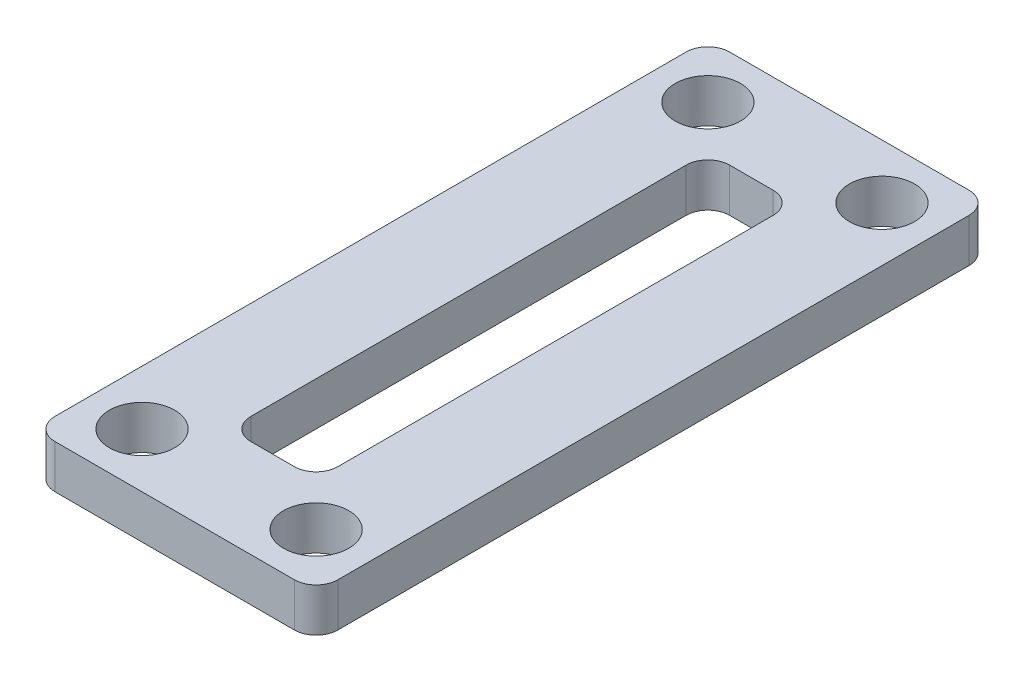
ISO-10303-21;
HEADER;
FILE_DESCRIPTION(('STEP AP214'),'2;1');
FILE_NAME('part.step','',(''),(''),'','','');
FILE_SCHEMA(('AUTOMOTIVE_DESIGN { 1 0 10303 214 1 1 1 1 }'));
ENDSEC;
DATA;
#1=APPLICATION_CONTEXT('core data for automotive mechanical design processes');
#2=APPLICATION_PROTOCOL_DEFINITION('international standard','automotive_design',2000,#1);
#3=PRODUCT_CONTEXT('',#1,'mechanical');
#4=PRODUCT('Part','Part','',(#3));
#5=PRODUCT_RELATED_PRODUCT_CATEGORY('part','',(#4));
#6=PRODUCT_DEFINITION_FORMATION('','',#4);
#7=PRODUCT_DEFINITION_CONTEXT('part definition',#1,'design');
#8=PRODUCT_DEFINITION('design','',#6,#7);
#9=PRODUCT_DEFINITION_SHAPE('','',#8);
#10=(LENGTH_UNIT() NAMED_UNIT(*) SI_UNIT(.MILLI.,.METRE.));
#11=(NAMED_UNIT(*) PLANE_ANGLE_UNIT() SI_UNIT($,.RADIAN.));
#12=(NAMED_UNIT(*) SI_UNIT($,.STERADIAN.) SOLID_ANGLE_UNIT());
#13=UNCERTAINTY_MEASURE_WITH_UNIT(LENGTH_MEASURE(1.E-05),#10,'distance_accuracy_value','');
#14=(GEOMETRIC_REPRESENTATION_CONTEXT(3) GLOBAL_UNCERTAINTY_ASSIGNED_CONTEXT((#13)) GLOBAL_UNIT_ASSIGNED_CONTEXT((#10,
#11,#12)) REPRESENTATION_CONTEXT('',''));
#15=CARTESIAN_POINT('',(0.,0.,0.));
#16=DIRECTION('',(0.,0.,1.));
#17=DIRECTION('',(1.,0.,0.));
#18=AXIS2_PLACEMENT_3D('',#15,#16,#17);
#19=CARTESIAN_POINT('',(10.5,5.5,-28.5));
#20=DIRECTION('',(-1.,0.,0.));
#21=DIRECTION('',(0.,0.,1.));
#22=AXIS2_PLACEMENT_3D('',#19,#20,#21);
#23=PLANE('',#22);
#24=DIRECTION('',(0.,0.,-1.));
#25=VECTOR('',#24,1.);
#26=CARTESIAN_POINT('',(10.5,2.,-28.5));
#27=LINE('',#26,#25);
#28=CARTESIAN_POINT('',(10.5,2.,1.5));
#29=VERTEX_POINT('',#28);
#30=CARTESIAN_POINT('',(10.5,2.,-27.5));
#31=VERTEX_POINT('',#30);
#32=EDGE_CURVE('E148',#29,#31,#27,.T.);
#33=ORIENTED_EDGE('',*,*,#32,.F.);
#34=DIRECTION('',(0.,-1.,0.));
#35=VECTOR('',#34,1.);
#36=CARTESIAN_POINT('',(10.5,5.5,1.5));
#37=LINE('',#36,#35);
#38=CARTESIAN_POINT('',(10.5,0.,1.5));
#39=VERTEX_POINT('',#38);
#40=EDGE_CURVE('E159',#29,#39,#37,.T.);
#41=ORIENTED_EDGE('',*,*,#40,.T.);
#42=DIRECTION('',(0.,0.,-1.));
#43=VECTOR('',#42,1.);
#44=CARTESIAN_POINT('',(10.5,0.,-28.5));
#45=LINE('',#44,#43);
#46=CARTESIAN_POINT('',(10.5,0.,-27.5));
#47=VERTEX_POINT('',#46);
#48=EDGE_CURVE('E229',#39,#47,#45,.T.);
#49=ORIENTED_EDGE('',*,*,#48,.T.);
#50=DIRECTION('',(0.,-1.,0.));
#51=VECTOR('',#50,1.);
#52=CARTESIAN_POINT('',(10.5,5.5,-27.5));
#53=LINE('',#52,#51);
#54=EDGE_CURVE('E162',#47,#31,#53,.F.);
#55=ORIENTED_EDGE('',*,*,#54,.T.);
#56=EDGE_LOOP('',(#33,#41,#49,#55));
#57=FACE_BOUND('',#56,.T.);
#58=ADVANCED_FACE('F34',(#57),#23,.F.);
#59=CARTESIAN_POINT('',(-2.5,5.5,-28.5));
#60=DIRECTION('',(0.,0.,1.));
#61=DIRECTION('',(1.,0.,0.));
#62=AXIS2_PLACEMENT_3D('',#59,#60,#61);
#63=PLANE('',#62);
#64=DIRECTION('',(-1.,0.,0.));
#65=VECTOR('',#64,1.);
#66=CARTESIAN_POINT('',(-2.5,2.,-28.5));
#67=LINE('',#66,#65);
#68=CARTESIAN_POINT('',(9.5,2.,-28.5));
#69=VERTEX_POINT('',#68);
#70=CARTESIAN_POINT('',(-1.5,2.,-28.5));
#71=VERTEX_POINT('',#70);
#72=EDGE_CURVE('E279',#69,#71,#67,.T.);
#73=ORIENTED_EDGE('',*,*,#72,.F.);
#74=DIRECTION('',(0.,-1.,0.));
#75=VECTOR('',#74,1.);
#76=CARTESIAN_POINT('',(9.5,5.5,-28.5));
#77=LINE('',#76,#75);
#78=CARTESIAN_POINT('',(9.5,0.,-28.5));
#79=VERTEX_POINT('',#78);
#80=EDGE_CURVE('E172',#69,#79,#77,.T.);
#81=ORIENTED_EDGE('',*,*,#80,.T.);
#82=DIRECTION('',(-1.,0.,0.));
#83=VECTOR('',#82,1.);
#84=CARTESIAN_POINT('',(-2.5,0.,-28.5));
#85=LINE('',#84,#83);
#86=CARTESIAN_POINT('',(-1.5,0.,-28.5));
#87=VERTEX_POINT('',#86);
#88=EDGE_CURVE('E235',#79,#87,#85,.T.);
#89=ORIENTED_EDGE('',*,*,#88,.T.);
#90=DIRECTION('',(0.,-1.,0.));
#91=VECTOR('',#90,1.);
#92=CARTESIAN_POINT('',(-1.5,5.5,-28.5));
#93=LINE('',#92,#91);
#94=EDGE_CURVE('E167',#87,#71,#93,.F.);
#95=ORIENTED_EDGE('',*,*,#94,.T.);
#96=EDGE_LOOP('',(#73,#81,#89,#95));
#97=FACE_BOUND('',#96,.T.);
#98=ADVANCED_FACE('F276',(#97),#63,.F.);
#99=CARTESIAN_POINT('',(-2.5,5.5,2.5));
#100=DIRECTION('',(1.,0.,0.));
#101=DIRECTION('',(0.,0.,-1.));
#102=AXIS2_PLACEMENT_3D('',#99,#100,#101);
#103=PLANE('',#102);
#104=DIRECTION('',(0.,0.,1.));
#105=VECTOR('',#104,1.);
#106=CARTESIAN_POINT('',(-2.5,2.,2.5));
#107=LINE('',#106,#105);
#108=CARTESIAN_POINT('',(-2.5,2.,-27.5));
#109=VERTEX_POINT('',#108);
#110=CARTESIAN_POINT('',(-2.5,2.,1.5));
#111=VERTEX_POINT('',#110);
#112=EDGE_CURVE('E292',#109,#111,#107,.T.);
#113=ORIENTED_EDGE('',*,*,#112,.F.);
#114=DIRECTION('',(0.,-1.,0.));
#115=VECTOR('',#114,1.);
#116=CARTESIAN_POINT('',(-2.5,5.5,-27.5));
#117=LINE('',#116,#115);
#118=CARTESIAN_POINT('',(-2.5,0.,-27.5));
#119=VERTEX_POINT('',#118);
#120=EDGE_CURVE('E264',#109,#119,#117,.T.);
#121=ORIENTED_EDGE('',*,*,#120,.T.);
#122=DIRECTION('',(0.,0.,1.));
#123=VECTOR('',#122,1.);
#124=CARTESIAN_POINT('',(-2.5,0.,2.5));
#125=LINE('',#124,#123);
#126=CARTESIAN_POINT('',(-2.5,0.,1.5));
#127=VERTEX_POINT('',#126);
#128=EDGE_CURVE('E214',#119,#127,#125,.T.);
#129=ORIENTED_EDGE('',*,*,#128,.T.);
#130=DIRECTION('',(0.,-1.,0.));
#131=VECTOR('',#130,1.);
#132=CARTESIAN_POINT('',(-2.5,5.5,1.5));
#133=LINE('',#132,#131);
#134=EDGE_CURVE('E261',#127,#111,#133,.F.);
#135=ORIENTED_EDGE('',*,*,#134,.T.);
#136=EDGE_LOOP('',(#113,#121,#129,#135));
#137=FACE_BOUND('',#136,.T.);
#138=ADVANCED_FACE('F353',(#137),#103,.F.);
#139=CARTESIAN_POINT('',(4.,5.5,2.5));
#140=DIRECTION('',(0.,0.,-1.));
#141=DIRECTION('',(-1.,0.,0.));
#142=AXIS2_PLACEMENT_3D('',#139,#140,#141);
#143=PLANE('',#142);
#144=DIRECTION('',(1.,0.,0.));
#145=VECTOR('',#144,1.);
#146=CARTESIAN_POINT('',(4.,2.,2.5));
#147=LINE('',#146,#145);
#148=CARTESIAN_POINT('',(-1.5,2.,2.5));
#149=VERTEX_POINT('',#148);
#150=CARTESIAN_POINT('',(9.50000000000001,2.,2.5));
#151=VERTEX_POINT('',#150);
#152=EDGE_CURVE('E59',#149,#151,#147,.T.);
#153=ORIENTED_EDGE('',*,*,#152,.F.);
#154=DIRECTION('',(0.,-1.,0.));
#155=VECTOR('',#154,1.);
#156=CARTESIAN_POINT('',(-1.5,5.5,2.5));
#157=LINE('',#156,#155);
#158=CARTESIAN_POINT('',(-1.5,0.,2.5));
#159=VERTEX_POINT('',#158);
#160=EDGE_CURVE('E177',#149,#159,#157,.T.);
#161=ORIENTED_EDGE('',*,*,#160,.T.);
#162=DIRECTION('',(1.,0.,0.));
#163=VECTOR('',#162,1.);
#164=CARTESIAN_POINT('',(4.,0.,2.5));
#165=LINE('',#164,#163);
#166=CARTESIAN_POINT('',(9.50000000000001,0.,2.5));
#167=VERTEX_POINT('',#166);
#168=EDGE_CURVE('E239',#159,#167,#165,.T.);
#169=ORIENTED_EDGE('',*,*,#168,.T.);
#170=DIRECTION('',(0.,-1.,0.));
#171=VECTOR('',#170,1.);
#172=CARTESIAN_POINT('',(9.50000000000001,5.5,2.5));
#173=LINE('',#172,#171);
#174=EDGE_CURVE('E169',#167,#151,#173,.F.);
#175=ORIENTED_EDGE('',*,*,#174,.T.);
#176=EDGE_LOOP('',(#153,#161,#169,#175));
#177=FACE_BOUND('',#176,.T.);
#178=ADVANCED_FACE('F476',(#177),#143,.F.);
#179=CARTESIAN_POINT('',(2.,5.5,-24.));
#180=DIRECTION('',(0.,0.,1.));
#181=DIRECTION('',(1.,0.,0.));
#182=AXIS2_PLACEMENT_3D('',#179,#180,#181);
#183=PLANE('',#182);
#184=DIRECTION('',(0.,-1.,0.));
#185=VECTOR('',#184,1.);
#186=CARTESIAN_POINT('',(5.,5.5,-24.));
#187=LINE('',#186,#185);
#188=CARTESIAN_POINT('',(5.,0.,-24.));
#189=VERTEX_POINT('',#188);
#190=CARTESIAN_POINT('',(5.,2.,-24.));
#191=VERTEX_POINT('',#190);
#192=EDGE_CURVE('E258',#189,#191,#187,.F.);
#193=ORIENTED_EDGE('',*,*,#192,.T.);
#194=DIRECTION('',(-1.,0.,0.));
#195=VECTOR('',#194,1.);
#196=CARTESIAN_POINT('',(2.,2.,-24.));
#197=LINE('',#196,#195);
#198=CARTESIAN_POINT('',(3.,2.,-24.));
#199=VERTEX_POINT('',#198);
#200=EDGE_CURVE('E297',#191,#199,#197,.T.);
#201=ORIENTED_EDGE('',*,*,#200,.T.);
#202=DIRECTION('',(0.,-1.,0.));
#203=VECTOR('',#202,1.);
#204=CARTESIAN_POINT('',(3.,0.,-24.));
#205=LINE('',#204,#203);
#206=CARTESIAN_POINT('',(3.,0.,-24.));
#207=VERTEX_POINT('',#206);
#208=EDGE_CURVE('E256',#199,#207,#205,.T.);
#209=ORIENTED_EDGE('',*,*,#208,.T.);
#210=DIRECTION('',(-1.,0.,0.));
#211=VECTOR('',#210,1.);
#212=CARTESIAN_POINT('',(2.,0.,-24.));
#213=LINE('',#212,#211);
#214=EDGE_CURVE('E187',#189,#207,#213,.T.);
#215=ORIENTED_EDGE('',*,*,#214,.F.);
#216=EDGE_LOOP('',(#193,#201,#209,#215));
#217=FACE_BOUND('',#216,.T.);
#218=ADVANCED_FACE('F317',(#217),#183,.T.);
#219=CARTESIAN_POINT('',(2.,5.5,-2.));
#220=DIRECTION('',(1.,0.,0.));
#221=DIRECTION('',(0.,0.,-1.));
#222=AXIS2_PLACEMENT_3D('',#219,#220,#221);
#223=PLANE('',#222);
#224=DIRECTION('',(0.,-1.,0.));
#225=VECTOR('',#224,1.);
#226=CARTESIAN_POINT('',(2.,5.5,-23.));
#227=LINE('',#226,#225);
#228=CARTESIAN_POINT('',(2.,0.,-23.));
#229=VERTEX_POINT('',#228);
#230=CARTESIAN_POINT('',(2.,2.,-23.));
#231=VERTEX_POINT('',#230);
#232=EDGE_CURVE('E251',#229,#231,#227,.F.);
#233=ORIENTED_EDGE('',*,*,#232,.T.);
#234=DIRECTION('',(0.,0.,1.));
#235=VECTOR('',#234,1.);
#236=CARTESIAN_POINT('',(2.,2.,-2.));
#237=LINE('',#236,#235);
#238=CARTESIAN_POINT('',(2.,2.,-3.));
#239=VERTEX_POINT('',#238);
#240=EDGE_CURVE('E51',#231,#239,#237,.T.);
#241=ORIENTED_EDGE('',*,*,#240,.T.);
#242=DIRECTION('',(0.,-1.,0.));
#243=VECTOR('',#242,1.);
#244=CARTESIAN_POINT('',(2.,0.,-3.));
#245=LINE('',#244,#243);
#246=CARTESIAN_POINT('',(2.,0.,-3.));
#247=VERTEX_POINT('',#246);
#248=EDGE_CURVE('E254',#239,#247,#245,.T.);
#249=ORIENTED_EDGE('',*,*,#248,.T.);
#250=DIRECTION('',(0.,0.,1.));
#251=VECTOR('',#250,1.);
#252=CARTESIAN_POINT('',(2.,0.,-2.));
#253=LINE('',#252,#251);
#254=EDGE_CURVE('E227',#229,#247,#253,.T.);
#255=ORIENTED_EDGE('',*,*,#254,.F.);
#256=EDGE_LOOP('',(#233,#241,#249,#255));
#257=FACE_BOUND('',#256,.T.);
#258=ADVANCED_FACE('F336',(#257),#223,.T.);
#259=CARTESIAN_POINT('',(6.,5.5,-2.));
#260=DIRECTION('',(0.,0.,-1.));
#261=DIRECTION('',(-1.,0.,0.));
#262=AXIS2_PLACEMENT_3D('',#259,#260,#261);
#263=PLANE('',#262);
#264=DIRECTION('',(0.,-1.,0.));
#265=VECTOR('',#264,1.);
#266=CARTESIAN_POINT('',(3.,5.5,-2.));
#267=LINE('',#266,#265);
#268=CARTESIAN_POINT('',(3.,0.,-2.));
#269=VERTEX_POINT('',#268);
#270=CARTESIAN_POINT('',(3.,2.,-2.));
#271=VERTEX_POINT('',#270);
#272=EDGE_CURVE('E242',#269,#271,#267,.F.);
#273=ORIENTED_EDGE('',*,*,#272,.T.);
#274=DIRECTION('',(1.,0.,0.));
#275=VECTOR('',#274,1.);
#276=CARTESIAN_POINT('',(6.,2.,-2.));
#277=LINE('',#276,#275);
#278=CARTESIAN_POINT('',(5.,2.,-2.));
#279=VERTEX_POINT('',#278);
#280=EDGE_CURVE('E307',#271,#279,#277,.T.);
#281=ORIENTED_EDGE('',*,*,#280,.T.);
#282=DIRECTION('',(0.,-1.,0.));
#283=VECTOR('',#282,1.);
#284=CARTESIAN_POINT('',(5.,0.,-2.));
#285=LINE('',#284,#283);
#286=CARTESIAN_POINT('',(5.,0.,-2.));
#287=VERTEX_POINT('',#286);
#288=EDGE_CURVE('E244',#279,#287,#285,.T.);
#289=ORIENTED_EDGE('',*,*,#288,.T.);
#290=DIRECTION('',(1.,0.,0.));
#291=VECTOR('',#290,1.);
#292=CARTESIAN_POINT('',(6.,0.,-2.));
#293=LINE('',#292,#291);
#294=EDGE_CURVE('E217',#269,#287,#293,.T.);
#295=ORIENTED_EDGE('',*,*,#294,.F.);
#296=EDGE_LOOP('',(#273,#281,#289,#295));
#297=FACE_BOUND('',#296,.T.);
#298=ADVANCED_FACE('F331',(#297),#263,.T.);
#299=CARTESIAN_POINT('',(6.,5.5,-24.));
#300=DIRECTION('',(-1.,0.,0.));
#301=DIRECTION('',(0.,0.,1.));
#302=AXIS2_PLACEMENT_3D('',#299,#300,#301);
#303=PLANE('',#302);
#304=DIRECTION('',(0.,-1.,0.));
#305=VECTOR('',#304,1.);
#306=CARTESIAN_POINT('',(6.,5.5,-3.));
#307=LINE('',#306,#305);
#308=CARTESIAN_POINT('',(6.,0.,-3.));
#309=VERTEX_POINT('',#308);
#310=CARTESIAN_POINT('',(6.,2.,-3.));
#311=VERTEX_POINT('',#310);
#312=EDGE_CURVE('E248',#309,#311,#307,.F.);
#313=ORIENTED_EDGE('',*,*,#312,.T.);
#314=DIRECTION('',(0.,0.,-1.));
#315=VECTOR('',#314,1.);
#316=CARTESIAN_POINT('',(6.,2.,-24.));
#317=LINE('',#316,#315);
#318=CARTESIAN_POINT('',(6.,2.,-23.));
#319=VERTEX_POINT('',#318);
#320=EDGE_CURVE('E304',#311,#319,#317,.T.);
#321=ORIENTED_EDGE('',*,*,#320,.T.);
#322=DIRECTION('',(0.,-1.,0.));
#323=VECTOR('',#322,1.);
#324=CARTESIAN_POINT('',(6.,0.,-23.));
#325=LINE('',#324,#323);
#326=CARTESIAN_POINT('',(6.,0.,-23.));
#327=VERTEX_POINT('',#326);
#328=EDGE_CURVE('E246',#319,#327,#325,.T.);
#329=ORIENTED_EDGE('',*,*,#328,.T.);
#330=DIRECTION('',(0.,0.,-1.));
#331=VECTOR('',#330,1.);
#332=CARTESIAN_POINT('',(6.,0.,-24.));
#333=LINE('',#332,#331);
#334=EDGE_CURVE('E226',#309,#327,#333,.T.);
#335=ORIENTED_EDGE('',*,*,#334,.F.);
#336=EDGE_LOOP('',(#313,#321,#329,#335));
#337=FACE_BOUND('',#336,.T.);
#338=ADVANCED_FACE('F325',(#337),#303,.T.);
#339=CARTESIAN_POINT('',(5.,5.5,-3.));
#340=DIRECTION('',(0.,1.,0.));
#341=DIRECTION('',(0.,0.,1.));
#342=AXIS2_PLACEMENT_3D('',#339,#340,#341);
#343=CYLINDRICAL_SURFACE('',#342,1.);
#344=CARTESIAN_POINT('',(5.,2.,-3.));
#345=DIRECTION('',(0.,1.,0.));
#346=DIRECTION('',(0.,0.,1.));
#347=AXIS2_PLACEMENT_3D('',#344,#345,#346);
#348=CIRCLE('',#347,1.);
#349=EDGE_CURVE('E193',#311,#279,#348,.F.);
#350=ORIENTED_EDGE('',*,*,#349,.F.);
#351=ORIENTED_EDGE('',*,*,#312,.F.);
#352=CARTESIAN_POINT('',(5.,0.,-3.));
#353=DIRECTION('',(0.,-1.,0.));
#354=DIRECTION('',(0.,0.,-1.));
#355=AXIS2_PLACEMENT_3D('',#352,#353,#354);
#356=CIRCLE('',#355,1.);
#357=EDGE_CURVE('E179',#287,#309,#356,.F.);
#358=ORIENTED_EDGE('',*,*,#357,.F.);
#359=ORIENTED_EDGE('',*,*,#288,.F.);
#360=EDGE_LOOP('',(#350,#351,#358,#359));
#361=FACE_BOUND('',#360,.T.);
#362=ADVANCED_FACE('F328',(#361),#343,.F.);
#363=CARTESIAN_POINT('',(3.,5.5,-3.));
#364=DIRECTION('',(0.,1.,0.));
#365=DIRECTION('',(0.,0.,1.));
#366=AXIS2_PLACEMENT_3D('',#363,#364,#365);
#367=CYLINDRICAL_SURFACE('',#366,1.);
#368=CARTESIAN_POINT('',(3.,2.,-3.));
#369=DIRECTION('',(0.,1.,0.));
#370=DIRECTION('',(0.,0.,1.));
#371=AXIS2_PLACEMENT_3D('',#368,#369,#370);
#372=CIRCLE('',#371,1.);
#373=EDGE_CURVE('E302',#271,#239,#372,.F.);
#374=ORIENTED_EDGE('',*,*,#373,.F.);
#375=ORIENTED_EDGE('',*,*,#272,.F.);
#376=CARTESIAN_POINT('',(3.,0.,-3.));
#377=DIRECTION('',(0.,-1.,0.));
#378=DIRECTION('',(0.,0.,-1.));
#379=AXIS2_PLACEMENT_3D('',#376,#377,#378);
#380=CIRCLE('',#379,1.);
#381=EDGE_CURVE('E181',#247,#269,#380,.F.);
#382=ORIENTED_EDGE('',*,*,#381,.F.);
#383=ORIENTED_EDGE('',*,*,#248,.F.);
#384=EDGE_LOOP('',(#374,#375,#382,#383));
#385=FACE_BOUND('',#384,.T.);
#386=ADVANCED_FACE('F333',(#385),#367,.F.);
#387=CARTESIAN_POINT('',(5.,5.5,-23.));
#388=DIRECTION('',(0.,1.,0.));
#389=DIRECTION('',(0.,0.,1.));
#390=AXIS2_PLACEMENT_3D('',#387,#388,#389);
#391=CYLINDRICAL_SURFACE('',#390,1.);
#392=CARTESIAN_POINT('',(5.,2.,-23.));
#393=DIRECTION('',(0.,1.,0.));
#394=DIRECTION('',(0.,0.,1.));
#395=AXIS2_PLACEMENT_3D('',#392,#393,#394);
#396=CIRCLE('',#395,1.);
#397=EDGE_CURVE('E300',#191,#319,#396,.F.);
#398=ORIENTED_EDGE('',*,*,#397,.F.);
#399=ORIENTED_EDGE('',*,*,#192,.F.);
#400=CARTESIAN_POINT('',(5.,0.,-23.));
#401=DIRECTION('',(0.,-1.,0.));
#402=DIRECTION('',(0.,0.,-1.));
#403=AXIS2_PLACEMENT_3D('',#400,#401,#402);
#404=CIRCLE('',#403,1.);
#405=EDGE_CURVE('E43',#327,#189,#404,.F.);
#406=ORIENTED_EDGE('',*,*,#405,.F.);
#407=ORIENTED_EDGE('',*,*,#328,.F.);
#408=EDGE_LOOP('',(#398,#399,#406,#407));
#409=FACE_BOUND('',#408,.T.);
#410=ADVANCED_FACE('F321',(#409),#391,.F.);
#411=CARTESIAN_POINT('',(3.,5.5,-23.));
#412=DIRECTION('',(0.,1.,0.));
#413=DIRECTION('',(0.,0.,1.));
#414=AXIS2_PLACEMENT_3D('',#411,#412,#413);
#415=CYLINDRICAL_SURFACE('',#414,1.);
#416=CARTESIAN_POINT('',(3.,2.,-23.));
#417=DIRECTION('',(0.,1.,0.));
#418=DIRECTION('',(0.,0.,1.));
#419=AXIS2_PLACEMENT_3D('',#416,#417,#418);
#420=CIRCLE('',#419,1.);
#421=EDGE_CURVE('E289',#231,#199,#420,.F.);
#422=ORIENTED_EDGE('',*,*,#421,.F.);
#423=ORIENTED_EDGE('',*,*,#232,.F.);
#424=CARTESIAN_POINT('',(3.,0.,-23.));
#425=DIRECTION('',(0.,-1.,0.));
#426=DIRECTION('',(0.,0.,-1.));
#427=AXIS2_PLACEMENT_3D('',#424,#425,#426);
#428=CIRCLE('',#427,1.);
#429=EDGE_CURVE('E11',#207,#229,#428,.F.);
#430=ORIENTED_EDGE('',*,*,#429,.F.);
#431=ORIENTED_EDGE('',*,*,#208,.F.);
#432=EDGE_LOOP('',(#422,#423,#430,#431));
#433=FACE_BOUND('',#432,.T.);
#434=ADVANCED_FACE('F339',(#433),#415,.F.);
#435=CARTESIAN_POINT('',(-1.5,5.5,-27.5));
#436=DIRECTION('',(0.,-1.,0.));
#437=DIRECTION('',(0.,0.,-1.));
#438=AXIS2_PLACEMENT_3D('',#435,#436,#437);
#439=CYLINDRICAL_SURFACE('',#438,1.);
#440=ORIENTED_EDGE('',*,*,#120,.F.);
#441=CARTESIAN_POINT('',(-1.5,2.,-27.5));
#442=DIRECTION('',(0.,1.,0.));
#443=DIRECTION('',(0.,0.,1.));
#444=AXIS2_PLACEMENT_3D('',#441,#442,#443);
#445=CIRCLE('',#444,1.);
#446=EDGE_CURVE('E287',#109,#71,#445,.F.);
#447=ORIENTED_EDGE('',*,*,#446,.T.);
#448=ORIENTED_EDGE('',*,*,#94,.F.);
#449=CARTESIAN_POINT('',(-1.5,0.,-27.5));
#450=DIRECTION('',(0.,-1.,0.));
#451=DIRECTION('',(0.,0.,-1.));
#452=AXIS2_PLACEMENT_3D('',#449,#450,#451);
#453=CIRCLE('',#452,1.);
#454=EDGE_CURVE('E271',#119,#87,#453,.T.);
#455=ORIENTED_EDGE('',*,*,#454,.F.);
#456=EDGE_LOOP('',(#440,#447,#448,#455));
#457=FACE_BOUND('',#456,.T.);
#458=ADVANCED_FACE('F285',(#457),#439,.T.);
#459=CARTESIAN_POINT('',(9.5,5.5,-27.5));
#460=DIRECTION('',(0.,-1.,0.));
#461=DIRECTION('',(0.,0.,-1.));
#462=AXIS2_PLACEMENT_3D('',#459,#460,#461);
#463=CYLINDRICAL_SURFACE('',#462,1.);
#464=ORIENTED_EDGE('',*,*,#80,.F.);
#465=CARTESIAN_POINT('',(9.5,2.,-27.5));
#466=DIRECTION('',(0.,1.,0.));
#467=DIRECTION('',(0.,0.,1.));
#468=AXIS2_PLACEMENT_3D('',#465,#466,#467);
#469=CIRCLE('',#468,1.);
#470=EDGE_CURVE('E538',#69,#31,#469,.F.);
#471=ORIENTED_EDGE('',*,*,#470,.T.);
#472=ORIENTED_EDGE('',*,*,#54,.F.);
#473=CARTESIAN_POINT('',(9.5,0.,-27.5));
#474=DIRECTION('',(0.,-1.,0.));
#475=DIRECTION('',(0.,0.,-1.));
#476=AXIS2_PLACEMENT_3D('',#473,#474,#475);
#477=CIRCLE('',#476,1.);
#478=EDGE_CURVE('E269',#79,#47,#477,.T.);
#479=ORIENTED_EDGE('',*,*,#478,.F.);
#480=EDGE_LOOP('',(#464,#471,#472,#479));
#481=FACE_BOUND('',#480,.T.);
#482=ADVANCED_FACE('F281',(#481),#463,.T.);
#483=CARTESIAN_POINT('',(-1.5,5.5,1.5));
#484=DIRECTION('',(0.,-1.,0.));
#485=DIRECTION('',(0.,0.,-1.));
#486=AXIS2_PLACEMENT_3D('',#483,#484,#485);
#487=CYLINDRICAL_SURFACE('',#486,1.);
#488=ORIENTED_EDGE('',*,*,#160,.F.);
#489=CARTESIAN_POINT('',(-1.5,2.,1.5));
#490=DIRECTION('',(0.,1.,0.));
#491=DIRECTION('',(0.,0.,1.));
#492=AXIS2_PLACEMENT_3D('',#489,#490,#491);
#493=CIRCLE('',#492,1.);
#494=EDGE_CURVE('E163',#149,#111,#493,.F.);
#495=ORIENTED_EDGE('',*,*,#494,.T.);
#496=ORIENTED_EDGE('',*,*,#134,.F.);
#497=CARTESIAN_POINT('',(-1.5,0.,1.5));
#498=DIRECTION('',(0.,-1.,0.));
#499=DIRECTION('',(0.,0.,-1.));
#500=AXIS2_PLACEMENT_3D('',#497,#498,#499);
#501=CIRCLE('',#500,1.);
#502=EDGE_CURVE('E267',#159,#127,#501,.T.);
#503=ORIENTED_EDGE('',*,*,#502,.F.);
#504=EDGE_LOOP('',(#488,#495,#496,#503));
#505=FACE_BOUND('',#504,.T.);
#506=ADVANCED_FACE('F388',(#505),#487,.T.);
#507=CARTESIAN_POINT('',(9.50000000000001,5.5,1.5));
#508=DIRECTION('',(0.,-1.,0.));
#509=DIRECTION('',(0.,0.,-1.));
#510=AXIS2_PLACEMENT_3D('',#507,#508,#509);
#511=CYLINDRICAL_SURFACE('',#510,1.);
#512=ORIENTED_EDGE('',*,*,#40,.F.);
#513=CARTESIAN_POINT('',(9.50000000000001,2.,1.5));
#514=DIRECTION('',(0.,1.,0.));
#515=DIRECTION('',(0.,0.,1.));
#516=AXIS2_PLACEMENT_3D('',#513,#514,#515);
#517=CIRCLE('',#516,1.);
#518=EDGE_CURVE('E145',#29,#151,#517,.F.);
#519=ORIENTED_EDGE('',*,*,#518,.T.);
#520=ORIENTED_EDGE('',*,*,#174,.F.);
#521=CARTESIAN_POINT('',(9.50000000000001,0.,1.5));
#522=DIRECTION('',(0.,-1.,0.));
#523=DIRECTION('',(0.,0.,-1.));
#524=AXIS2_PLACEMENT_3D('',#521,#522,#523);
#525=CIRCLE('',#524,1.);
#526=EDGE_CURVE('E165',#39,#167,#525,.T.);
#527=ORIENTED_EDGE('',*,*,#526,.F.);
#528=EDGE_LOOP('',(#512,#519,#520,#527));
#529=FACE_BOUND('',#528,.T.);
#530=ADVANCED_FACE('F36',(#529),#511,.T.);
#531=CARTESIAN_POINT('',(0.,-4.5,-26.));
#532=DIRECTION('',(0.,1.,0.));
#533=DIRECTION('',(0.,0.,1.));
#534=AXIS2_PLACEMENT_3D('',#531,#532,#533);
#535=CYLINDRICAL_SURFACE('',#534,1.5);
#536=CARTESIAN_POINT('',(0.,0.,-26.));
#537=DIRECTION('',(0.,-1.,0.));
#538=DIRECTION('',(0.,0.,-1.));
#539=AXIS2_PLACEMENT_3D('',#536,#537,#538);
#540=CIRCLE('',#539,1.5);
#541=CARTESIAN_POINT('',(0.,0.,-27.5));
#542=VERTEX_POINT('',#541);
#543=EDGE_CURVE('E184',#542,#542,#540,.T.);
#544=ORIENTED_EDGE('',*,*,#543,.T.);
#545=EDGE_LOOP('',(#544));
#546=FACE_BOUND('',#545,.T.);
#547=CARTESIAN_POINT('',(0.,2.,-26.));
#548=DIRECTION('',(0.,1.,0.));
#549=DIRECTION('',(0.,0.,1.));
#550=AXIS2_PLACEMENT_3D('',#547,#548,#549);
#551=CIRCLE('',#550,1.5);
#552=CARTESIAN_POINT('',(0.,2.,-24.5));
#553=VERTEX_POINT('',#552);
#554=EDGE_CURVE('E154',#553,#553,#551,.F.);
#555=ORIENTED_EDGE('',*,*,#554,.F.);
#556=EDGE_LOOP('',(#555));
#557=FACE_BOUND('',#556,.T.);
#558=ADVANCED_FACE('F405',(#546,#557),#535,.F.);
#559=CARTESIAN_POINT('',(0.,-4.5,0.));
#560=DIRECTION('',(0.,1.,0.));
#561=DIRECTION('',(0.,0.,1.));
#562=AXIS2_PLACEMENT_3D('',#559,#560,#561);
#563=CYLINDRICAL_SURFACE('',#562,1.5);
#564=CARTESIAN_POINT('',(0.,0.,0.));
#565=DIRECTION('',(0.,-1.,0.));
#566=DIRECTION('',(0.,0.,-1.));
#567=AXIS2_PLACEMENT_3D('',#564,#565,#566);
#568=CIRCLE('',#567,1.5);
#569=CARTESIAN_POINT('',(0.,0.,-1.5));
#570=VERTEX_POINT('',#569);
#571=EDGE_CURVE('E189',#570,#570,#568,.T.);
#572=ORIENTED_EDGE('',*,*,#571,.T.);
#573=EDGE_LOOP('',(#572));
#574=FACE_BOUND('',#573,.T.);
#575=CARTESIAN_POINT('',(0.,2.,0.));
#576=DIRECTION('',(0.,1.,0.));
#577=DIRECTION('',(0.,0.,1.));
#578=AXIS2_PLACEMENT_3D('',#575,#576,#577);
#579=CIRCLE('',#578,1.5);
#580=CARTESIAN_POINT('',(0.,2.,1.5));
#581=VERTEX_POINT('',#580);
#582=EDGE_CURVE('E544',#581,#581,#579,.F.);
#583=ORIENTED_EDGE('',*,*,#582,.F.);
#584=EDGE_LOOP('',(#583));
#585=FACE_BOUND('',#584,.T.);
#586=ADVANCED_FACE('F413',(#574,#585),#563,.F.);
#587=CARTESIAN_POINT('',(8.,-4.5,0.));
#588=DIRECTION('',(0.,1.,0.));
#589=DIRECTION('',(0.,0.,1.));
#590=AXIS2_PLACEMENT_3D('',#587,#588,#589);
#591=CYLINDRICAL_SURFACE('',#590,1.5);
#592=CARTESIAN_POINT('',(8.,0.,0.));
#593=DIRECTION('',(0.,-1.,0.));
#594=DIRECTION('',(0.,0.,-1.));
#595=AXIS2_PLACEMENT_3D('',#592,#593,#594);
#596=CIRCLE('',#595,1.5);
#597=CARTESIAN_POINT('',(8.,0.,-1.5));
#598=VERTEX_POINT('',#597);
#599=EDGE_CURVE('E192',#598,#598,#596,.T.);
#600=ORIENTED_EDGE('',*,*,#599,.T.);
#601=EDGE_LOOP('',(#600));
#602=FACE_BOUND('',#601,.T.);
#603=CARTESIAN_POINT('',(8.,2.,0.));
#604=DIRECTION('',(0.,1.,0.));
#605=DIRECTION('',(0.,0.,1.));
#606=AXIS2_PLACEMENT_3D('',#603,#604,#605);
#607=CIRCLE('',#606,1.5);
#608=CARTESIAN_POINT('',(8.,2.,1.5));
#609=VERTEX_POINT('',#608);
#610=EDGE_CURVE('E547',#609,#609,#607,.F.);
#611=ORIENTED_EDGE('',*,*,#610,.F.);
#612=EDGE_LOOP('',(#611));
#613=FACE_BOUND('',#612,.T.);
#614=ADVANCED_FACE('F423',(#602,#613),#591,.F.);
#615=CARTESIAN_POINT('',(8.,-4.5,-26.));
#616=DIRECTION('',(0.,1.,0.));
#617=DIRECTION('',(0.,0.,1.));
#618=AXIS2_PLACEMENT_3D('',#615,#616,#617);
#619=CYLINDRICAL_SURFACE('',#618,1.5);
#620=CARTESIAN_POINT('',(8.,0.,-26.));
#621=DIRECTION('',(0.,-1.,0.));
#622=DIRECTION('',(0.,0.,-1.));
#623=AXIS2_PLACEMENT_3D('',#620,#621,#622);
#624=CIRCLE('',#623,1.5);
#625=CARTESIAN_POINT('',(8.,0.,-27.5));
#626=VERTEX_POINT('',#625);
#627=EDGE_CURVE('E188',#626,#626,#624,.T.);
#628=ORIENTED_EDGE('',*,*,#627,.T.);
#629=EDGE_LOOP('',(#628));
#630=FACE_BOUND('',#629,.T.);
#631=CARTESIAN_POINT('',(8.,2.,-26.));
#632=DIRECTION('',(0.,1.,0.));
#633=DIRECTION('',(0.,0.,1.));
#634=AXIS2_PLACEMENT_3D('',#631,#632,#633);
#635=CIRCLE('',#634,1.5);
#636=CARTESIAN_POINT('',(8.,2.,-24.5));
#637=VERTEX_POINT('',#636);
#638=EDGE_CURVE('E38',#637,#637,#635,.F.);
#639=ORIENTED_EDGE('',*,*,#638,.F.);
#640=EDGE_LOOP('',(#639));
#641=FACE_BOUND('',#640,.T.);
#642=ADVANCED_FACE('F198',(#630,#641),#619,.F.);
#643=CARTESIAN_POINT('',(0.,0.,0.));
#644=DIRECTION('',(0.,-1.,0.));
#645=DIRECTION('',(0.,0.,-1.));
#646=AXIS2_PLACEMENT_3D('',#643,#644,#645);
#647=PLANE('',#646);
#648=ORIENTED_EDGE('',*,*,#627,.F.);
#649=EDGE_LOOP('',(#648));
#650=FACE_BOUND('',#649,.T.);
#651=ORIENTED_EDGE('',*,*,#599,.F.);
#652=EDGE_LOOP('',(#651));
#653=FACE_BOUND('',#652,.T.);
#654=ORIENTED_EDGE('',*,*,#571,.F.);
#655=EDGE_LOOP('',(#654));
#656=FACE_BOUND('',#655,.T.);
#657=ORIENTED_EDGE('',*,*,#543,.F.);
#658=EDGE_LOOP('',(#657));
#659=FACE_BOUND('',#658,.T.);
#660=ORIENTED_EDGE('',*,*,#128,.F.);
#661=ORIENTED_EDGE('',*,*,#454,.T.);
#662=ORIENTED_EDGE('',*,*,#88,.F.);
#663=ORIENTED_EDGE('',*,*,#478,.T.);
#664=ORIENTED_EDGE('',*,*,#48,.F.);
#665=ORIENTED_EDGE('',*,*,#526,.T.);
#666=ORIENTED_EDGE('',*,*,#168,.F.);
#667=ORIENTED_EDGE('',*,*,#502,.T.);
#668=EDGE_LOOP('',(#660,#661,#662,#663,#664,#665,#666,#667));
#669=FACE_BOUND('',#668,.T.);
#670=ORIENTED_EDGE('',*,*,#294,.T.);
#671=ORIENTED_EDGE('',*,*,#357,.T.);
#672=ORIENTED_EDGE('',*,*,#334,.T.);
#673=ORIENTED_EDGE('',*,*,#405,.T.);
#674=ORIENTED_EDGE('',*,*,#214,.T.);
#675=ORIENTED_EDGE('',*,*,#429,.T.);
#676=ORIENTED_EDGE('',*,*,#254,.T.);
#677=ORIENTED_EDGE('',*,*,#381,.T.);
#678=EDGE_LOOP('',(#670,#671,#672,#673,#674,#675,#676,#677));
#679=FACE_BOUND('',#678,.T.);
#680=ADVANCED_FACE('F201',(#650,#653,#656,#659,#669,#679),#647,.T.);
#681=CARTESIAN_POINT('',(0.,2.,0.));
#682=DIRECTION('',(0.,1.,0.));
#683=DIRECTION('',(0.,0.,1.));
#684=AXIS2_PLACEMENT_3D('',#681,#682,#683);
#685=PLANE('',#684);
#686=ORIENTED_EDGE('',*,*,#554,.T.);
#687=EDGE_LOOP('',(#686));
#688=FACE_BOUND('',#687,.T.);
#689=ORIENTED_EDGE('',*,*,#582,.T.);
#690=EDGE_LOOP('',(#689));
#691=FACE_BOUND('',#690,.T.);
#692=ORIENTED_EDGE('',*,*,#610,.T.);
#693=EDGE_LOOP('',(#692));
#694=FACE_BOUND('',#693,.T.);
#695=ORIENTED_EDGE('',*,*,#638,.T.);
#696=EDGE_LOOP('',(#695));
#697=FACE_BOUND('',#696,.T.);
#698=ORIENTED_EDGE('',*,*,#112,.T.);
#699=ORIENTED_EDGE('',*,*,#494,.F.);
#700=ORIENTED_EDGE('',*,*,#152,.T.);
#701=ORIENTED_EDGE('',*,*,#518,.F.);
#702=ORIENTED_EDGE('',*,*,#32,.T.);
#703=ORIENTED_EDGE('',*,*,#470,.F.);
#704=ORIENTED_EDGE('',*,*,#72,.T.);
#705=ORIENTED_EDGE('',*,*,#446,.F.);
#706=EDGE_LOOP('',(#698,#699,#700,#701,#702,#703,#704,#705));
#707=FACE_BOUND('',#706,.T.);
#708=ORIENTED_EDGE('',*,*,#349,.T.);
#709=ORIENTED_EDGE('',*,*,#280,.F.);
#710=ORIENTED_EDGE('',*,*,#373,.T.);
#711=ORIENTED_EDGE('',*,*,#240,.F.);
#712=ORIENTED_EDGE('',*,*,#421,.T.);
#713=ORIENTED_EDGE('',*,*,#200,.F.);
#714=ORIENTED_EDGE('',*,*,#397,.T.);
#715=ORIENTED_EDGE('',*,*,#320,.F.);
#716=EDGE_LOOP('',(#708,#709,#710,#711,#712,#713,#714,#715));
#717=FACE_BOUND('',#716,.T.);
#718=ADVANCED_FACE('F147',(#688,#691,#694,#697,#707,#717),#685,.T.);
#719=CLOSED_SHELL('',(#58,#98,#138,#178,#218,#258,#298,#338,#362,#386,#410,#434,#458,#482,#506,
#530,#558,#586,#614,#642,#680,#718));
#720=MANIFOLD_SOLID_BREP('B2',#719);
#721=ADVANCED_BREP_SHAPE_REPRESENTATION('',(#18,#720),#14);
#722=SHAPE_DEFINITION_REPRESENTATION(#9,#721);
ENDSEC;
END-ISO-10303-21;
